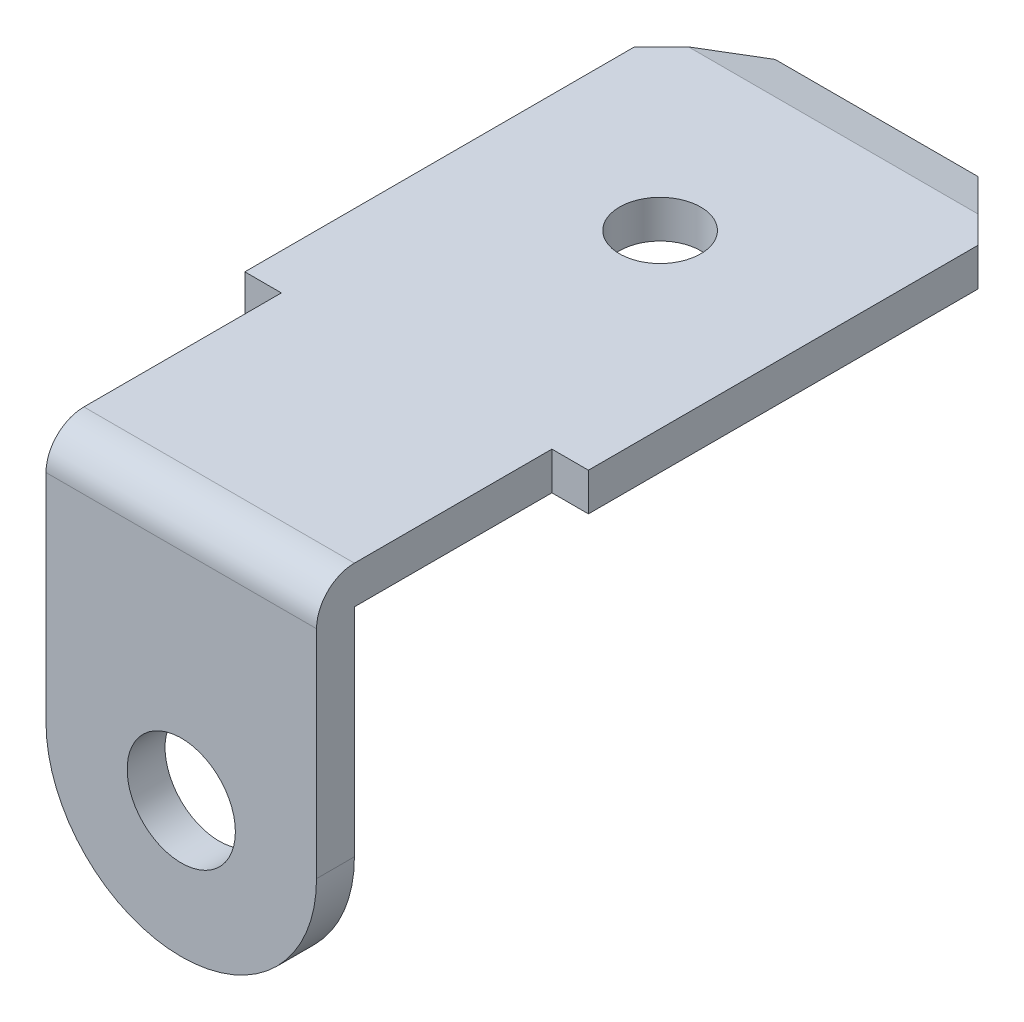
ISO-10303-21;
HEADER;
FILE_DESCRIPTION(('STEP AP214'),'2;1');
FILE_NAME('part.step','',(''),(''),'','','');
FILE_SCHEMA(('AUTOMOTIVE_DESIGN { 1 0 10303 214 1 1 1 1 }'));
ENDSEC;
DATA;
#1=APPLICATION_CONTEXT('core data for automotive mechanical design processes');
#2=APPLICATION_PROTOCOL_DEFINITION('international standard','automotive_design',2000,#1);
#3=PRODUCT_CONTEXT('',#1,'mechanical');
#4=PRODUCT('Part','Part','',(#3));
#5=PRODUCT_RELATED_PRODUCT_CATEGORY('part','',(#4));
#6=PRODUCT_DEFINITION_FORMATION('','',#4);
#7=PRODUCT_DEFINITION_CONTEXT('part definition',#1,'design');
#8=PRODUCT_DEFINITION('design','',#6,#7);
#9=PRODUCT_DEFINITION_SHAPE('','',#8);
#10=(LENGTH_UNIT() NAMED_UNIT(*) SI_UNIT(.MILLI.,.METRE.));
#11=(NAMED_UNIT(*) PLANE_ANGLE_UNIT() SI_UNIT($,.RADIAN.));
#12=(NAMED_UNIT(*) SI_UNIT($,.STERADIAN.) SOLID_ANGLE_UNIT());
#13=UNCERTAINTY_MEASURE_WITH_UNIT(LENGTH_MEASURE(1.E-05),#10,'distance_accuracy_value','');
#14=(GEOMETRIC_REPRESENTATION_CONTEXT(3) GLOBAL_UNCERTAINTY_ASSIGNED_CONTEXT((#13)) GLOBAL_UNIT_ASSIGNED_CONTEXT((#10,
#11,#12)) REPRESENTATION_CONTEXT('',''));
#15=CARTESIAN_POINT('',(0.,0.,0.));
#16=DIRECTION('',(0.,0.,1.));
#17=DIRECTION('',(1.,0.,0.));
#18=AXIS2_PLACEMENT_3D('',#15,#16,#17);
#19=CARTESIAN_POINT('',(0.,0.,0.));
#20=DIRECTION('',(0.,0.,1.));
#21=DIRECTION('',(1.,0.,0.));
#22=AXIS2_PLACEMENT_3D('',#19,#20,#21);
#23=CYLINDRICAL_SURFACE('',#22,1.);
#24=CARTESIAN_POINT('',(0.,0.,0.));
#25=DIRECTION('',(0.,0.,1.));
#26=DIRECTION('',(1.,0.,0.));
#27=AXIS2_PLACEMENT_3D('',#24,#25,#26);
#28=CIRCLE('',#27,1.);
#29=CARTESIAN_POINT('',(1.,0.,0.));
#30=VERTEX_POINT('',#29);
#31=EDGE_CURVE('E298',#30,#30,#28,.T.);
#32=ORIENTED_EDGE('',*,*,#31,.T.);
#33=DIRECTION('',(0.,0.,-1.));
#34=VECTOR('',#33,1.);
#35=CARTESIAN_POINT('',(1.,0.,0.));
#36=LINE('',#35,#34);
#37=CARTESIAN_POINT('',(1.,0.,-0.7));
#38=VERTEX_POINT('',#37);
#39=EDGE_CURVE('E11',#30,#38,#36,.T.);
#40=ORIENTED_EDGE('',*,*,#39,.T.);
#41=CARTESIAN_POINT('',(0.,0.,-0.7));
#42=DIRECTION('',(0.,0.,1.));
#43=DIRECTION('',(1.,0.,0.));
#44=AXIS2_PLACEMENT_3D('',#41,#42,#43);
#45=CIRCLE('',#44,1.);
#46=EDGE_CURVE('E21',#38,#38,#45,.T.);
#47=ORIENTED_EDGE('',*,*,#46,.F.);
#48=ORIENTED_EDGE('',*,*,#39,.F.);
#49=EDGE_LOOP('',(#32,#40,#47,#48));
#50=FACE_BOUND('',#49,.T.);
#51=ADVANCED_FACE('F17',(#50),#23,.F.);
#52=CARTESIAN_POINT('',(0.,1.283011768991,-0.7));
#53=DIRECTION('',(0.,0.,1.));
#54=DIRECTION('',(1.,0.,0.));
#55=AXIS2_PLACEMENT_3D('',#52,#53,#54);
#56=PLANE('',#55);
#57=ORIENTED_EDGE('',*,*,#46,.T.);
#58=EDGE_LOOP('',(#57));
#59=FACE_BOUND('',#58,.T.);
#60=DIRECTION('',(-1.,0.,0.));
#61=VECTOR('',#60,1.);
#62=CARTESIAN_POINT('',(2.5,4.,-0.7));
#63=LINE('',#62,#61);
#64=CARTESIAN_POINT('',(2.5,4.,-0.7));
#65=VERTEX_POINT('',#64);
#66=CARTESIAN_POINT('',(-2.5,4.,-0.7));
#67=VERTEX_POINT('',#66);
#68=EDGE_CURVE('E292',#65,#67,#63,.T.);
#69=ORIENTED_EDGE('',*,*,#68,.F.);
#70=DIRECTION('',(0.,1.,0.));
#71=VECTOR('',#70,1.);
#72=CARTESIAN_POINT('',(2.5,0.,-0.7));
#73=LINE('',#72,#71);
#74=CARTESIAN_POINT('',(2.5,0.,-0.7));
#75=VERTEX_POINT('',#74);
#76=EDGE_CURVE('E274',#75,#65,#73,.T.);
#77=ORIENTED_EDGE('',*,*,#76,.F.);
#78=CARTESIAN_POINT('',(0.,0.,-0.7));
#79=DIRECTION('',(0.,0.,1.));
#80=DIRECTION('',(1.,0.,0.));
#81=AXIS2_PLACEMENT_3D('',#78,#79,#80);
#82=CIRCLE('',#81,2.5);
#83=CARTESIAN_POINT('',(-2.5,0.,-0.7));
#84=VERTEX_POINT('',#83);
#85=EDGE_CURVE('E300',#84,#75,#82,.T.);
#86=ORIENTED_EDGE('',*,*,#85,.F.);
#87=DIRECTION('',(0.,-1.,0.));
#88=VECTOR('',#87,1.);
#89=CARTESIAN_POINT('',(-2.5,4.7,-0.7));
#90=LINE('',#89,#88);
#91=EDGE_CURVE('E247',#67,#84,#90,.T.);
#92=ORIENTED_EDGE('',*,*,#91,.F.);
#93=EDGE_LOOP('',(#69,#77,#86,#92));
#94=FACE_BOUND('',#93,.T.);
#95=ADVANCED_FACE('F19',(#59,#94),#56,.F.);
#96=CARTESIAN_POINT('',(0.,0.,0.));
#97=DIRECTION('',(0.,0.,1.));
#98=DIRECTION('',(1.,0.,0.));
#99=AXIS2_PLACEMENT_3D('',#96,#97,#98);
#100=CYLINDRICAL_SURFACE('',#99,2.5);
#101=DIRECTION('',(0.,0.,-1.));
#102=VECTOR('',#101,1.);
#103=CARTESIAN_POINT('',(-2.5,0.,0.));
#104=LINE('',#103,#102);
#105=CARTESIAN_POINT('',(-2.5,0.,0.));
#106=VERTEX_POINT('',#105);
#107=EDGE_CURVE('E251',#106,#84,#104,.T.);
#108=ORIENTED_EDGE('',*,*,#107,.T.);
#109=ORIENTED_EDGE('',*,*,#85,.T.);
#110=DIRECTION('',(0.,0.,-1.));
#111=VECTOR('',#110,1.);
#112=CARTESIAN_POINT('',(2.5,0.,0.));
#113=LINE('',#112,#111);
#114=CARTESIAN_POINT('',(2.5,0.,0.));
#115=VERTEX_POINT('',#114);
#116=EDGE_CURVE('E270',#115,#75,#113,.T.);
#117=ORIENTED_EDGE('',*,*,#116,.F.);
#118=CARTESIAN_POINT('',(0.,0.,0.));
#119=DIRECTION('',(0.,0.,1.));
#120=DIRECTION('',(1.,0.,0.));
#121=AXIS2_PLACEMENT_3D('',#118,#119,#120);
#122=CIRCLE('',#121,2.5);
#123=EDGE_CURVE('E295',#106,#115,#122,.T.);
#124=ORIENTED_EDGE('',*,*,#123,.F.);
#125=EDGE_LOOP('',(#108,#109,#117,#124));
#126=FACE_BOUND('',#125,.T.);
#127=ADVANCED_FACE('F319',(#126),#100,.T.);
#128=CARTESIAN_POINT('',(0.,1.283011768991,0.));
#129=DIRECTION('',(0.,0.,1.));
#130=DIRECTION('',(1.,0.,0.));
#131=AXIS2_PLACEMENT_3D('',#128,#129,#130);
#132=PLANE('',#131);
#133=ORIENTED_EDGE('',*,*,#31,.F.);
#134=EDGE_LOOP('',(#133));
#135=FACE_BOUND('',#134,.T.);
#136=DIRECTION('',(0.,1.,0.));
#137=VECTOR('',#136,1.);
#138=CARTESIAN_POINT('',(2.5,0.,0.));
#139=LINE('',#138,#137);
#140=CARTESIAN_POINT('',(2.5,4.,0.));
#141=VERTEX_POINT('',#140);
#142=EDGE_CURVE('E267',#115,#141,#139,.T.);
#143=ORIENTED_EDGE('',*,*,#142,.T.);
#144=DIRECTION('',(1.,0.,0.));
#145=VECTOR('',#144,1.);
#146=CARTESIAN_POINT('',(-2.5,4.,0.));
#147=LINE('',#146,#145);
#148=CARTESIAN_POINT('',(-2.5,4.,0.));
#149=VERTEX_POINT('',#148);
#150=EDGE_CURVE('E262',#149,#141,#147,.T.);
#151=ORIENTED_EDGE('',*,*,#150,.F.);
#152=DIRECTION('',(0.,-1.,0.));
#153=VECTOR('',#152,1.);
#154=CARTESIAN_POINT('',(-2.5,4.7,0.));
#155=LINE('',#154,#153);
#156=EDGE_CURVE('E229',#149,#106,#155,.T.);
#157=ORIENTED_EDGE('',*,*,#156,.T.);
#158=ORIENTED_EDGE('',*,*,#123,.T.);
#159=EDGE_LOOP('',(#143,#151,#157,#158));
#160=FACE_BOUND('',#159,.T.);
#161=ADVANCED_FACE('F353',(#135,#160),#132,.T.);
#162=CARTESIAN_POINT('',(0.,4.,-6.852754078708));
#163=DIRECTION('',(0.,1.,0.));
#164=DIRECTION('',(0.,0.,-1.));
#165=AXIS2_PLACEMENT_3D('',#162,#163,#164);
#166=PLANE('',#165);
#167=CARTESIAN_POINT('',(0.,4.,-8.85));
#168=DIRECTION('',(0.,1.,0.));
#169=DIRECTION('',(-1.,0.,0.));
#170=AXIS2_PLACEMENT_3D('',#167,#168,#169);
#171=CIRCLE('',#170,0.75);
#172=CARTESIAN_POINT('',(-0.75,4.,-8.85));
#173=VERTEX_POINT('',#172);
#174=EDGE_CURVE('E210',#173,#173,#171,.T.);
#175=ORIENTED_EDGE('',*,*,#174,.T.);
#176=EDGE_LOOP('',(#175));
#177=FACE_BOUND('',#176,.T.);
#178=DIRECTION('',(1.,0.,0.));
#179=VECTOR('',#178,1.);
#180=CARTESIAN_POINT('',(-1.875,4.,-12.05));
#181=LINE('',#180,#179);
#182=CARTESIAN_POINT('',(-2.675,4.,-12.05));
#183=VERTEX_POINT('',#182);
#184=CARTESIAN_POINT('',(2.675,4.,-12.05));
#185=VERTEX_POINT('',#184);
#186=EDGE_CURVE('E289',#183,#185,#181,.T.);
#187=ORIENTED_EDGE('',*,*,#186,.T.);
#188=DIRECTION('',(-0.707106781186548,0.,-0.707106781186548));
#189=VECTOR('',#188,1.);
#190=CARTESIAN_POINT('',(3.175,4.,-11.55));
#191=LINE('',#190,#189);
#192=CARTESIAN_POINT('',(3.175,4.,-11.55));
#193=VERTEX_POINT('',#192);
#194=EDGE_CURVE('E219',#193,#185,#191,.T.);
#195=ORIENTED_EDGE('',*,*,#194,.F.);
#196=DIRECTION('',(0.,0.,1.));
#197=VECTOR('',#196,1.);
#198=CARTESIAN_POINT('',(3.175,4.,-11.55));
#199=LINE('',#198,#197);
#200=CARTESIAN_POINT('',(3.175,4.,-4.35));
#201=VERTEX_POINT('',#200);
#202=EDGE_CURVE('E240',#193,#201,#199,.T.);
#203=ORIENTED_EDGE('',*,*,#202,.T.);
#204=DIRECTION('',(-1.,0.,0.));
#205=VECTOR('',#204,1.);
#206=CARTESIAN_POINT('',(3.175,4.,-4.35));
#207=LINE('',#206,#205);
#208=CARTESIAN_POINT('',(2.5,4.,-4.35));
#209=VERTEX_POINT('',#208);
#210=EDGE_CURVE('E258',#201,#209,#207,.T.);
#211=ORIENTED_EDGE('',*,*,#210,.T.);
#212=DIRECTION('',(0.,0.,1.));
#213=VECTOR('',#212,1.);
#214=CARTESIAN_POINT('',(2.5,4.,-4.35));
#215=LINE('',#214,#213);
#216=EDGE_CURVE('E278',#209,#65,#215,.T.);
#217=ORIENTED_EDGE('',*,*,#216,.T.);
#218=ORIENTED_EDGE('',*,*,#68,.T.);
#219=DIRECTION('',(0.,0.,-1.));
#220=VECTOR('',#219,1.);
#221=CARTESIAN_POINT('',(-2.5,4.,-0.7));
#222=LINE('',#221,#220);
#223=CARTESIAN_POINT('',(-2.5,4.,-4.35));
#224=VERTEX_POINT('',#223);
#225=EDGE_CURVE('E244',#67,#224,#222,.T.);
#226=ORIENTED_EDGE('',*,*,#225,.T.);
#227=DIRECTION('',(-1.,0.,0.));
#228=VECTOR('',#227,1.);
#229=CARTESIAN_POINT('',(-2.5,4.,-4.35));
#230=LINE('',#229,#228);
#231=CARTESIAN_POINT('',(-3.175,4.,-4.35));
#232=VERTEX_POINT('',#231);
#233=EDGE_CURVE('E224',#224,#232,#230,.T.);
#234=ORIENTED_EDGE('',*,*,#233,.T.);
#235=DIRECTION('',(0.,0.,-1.));
#236=VECTOR('',#235,1.);
#237=CARTESIAN_POINT('',(-3.175,4.,-4.35));
#238=LINE('',#237,#236);
#239=CARTESIAN_POINT('',(-3.175,4.,-11.55));
#240=VERTEX_POINT('',#239);
#241=EDGE_CURVE('E196',#232,#240,#238,.T.);
#242=ORIENTED_EDGE('',*,*,#241,.T.);
#243=DIRECTION('',(0.707106781186548,0.,-0.707106781186548));
#244=VECTOR('',#243,1.);
#245=CARTESIAN_POINT('',(-3.175,4.,-11.55));
#246=LINE('',#245,#244);
#247=EDGE_CURVE('E439',#240,#183,#246,.T.);
#248=ORIENTED_EDGE('',*,*,#247,.T.);
#249=EDGE_LOOP('',(#187,#195,#203,#211,#217,#218,#226,#234,#242,#248));
#250=FACE_BOUND('',#249,.T.);
#251=ADVANCED_FACE('F356',(#177,#250),#166,.F.);
#252=CARTESIAN_POINT('',(-1.875,4.1,-12.45));
#253=DIRECTION('',(0.,-0.970142500145391,-0.242535625036098));
#254=DIRECTION('',(0.,0.242535625036098,-0.970142500145391));
#255=AXIS2_PLACEMENT_3D('',#252,#253,#254);
#256=PLANE('',#255);
#257=DIRECTION('',(1.,0.,0.));
#258=VECTOR('',#257,1.);
#259=CARTESIAN_POINT('',(-1.875,4.2,-12.85));
#260=LINE('',#259,#258);
#261=CARTESIAN_POINT('',(-1.875,4.2,-12.85));
#262=VERTEX_POINT('',#261);
#263=CARTESIAN_POINT('',(1.875,4.2,-12.85));
#264=VERTEX_POINT('',#263);
#265=EDGE_CURVE('E286',#262,#264,#260,.T.);
#266=ORIENTED_EDGE('',*,*,#265,.T.);
#267=DIRECTION('',(-0.696310623822761,0.17407765595594,-0.696310623822761));
#268=VECTOR('',#267,1.);
#269=CARTESIAN_POINT('',(1.668939393939,4.251515151515,-13.05606060606));
#270=LINE('',#269,#268);
#271=EDGE_CURVE('E182',#185,#264,#270,.T.);
#272=ORIENTED_EDGE('',*,*,#271,.F.);
#273=ORIENTED_EDGE('',*,*,#186,.F.);
#274=DIRECTION('',(0.696310623822761,0.17407765595594,-0.696310623822761));
#275=VECTOR('',#274,1.);
#276=CARTESIAN_POINT('',(-2.57803030303,4.024242424242,-12.14696969697));
#277=LINE('',#276,#275);
#278=EDGE_CURVE('E436',#183,#262,#277,.T.);
#279=ORIENTED_EDGE('',*,*,#278,.T.);
#280=EDGE_LOOP('',(#266,#272,#273,#279));
#281=FACE_BOUND('',#280,.T.);
#282=ADVANCED_FACE('F370',(#281),#256,.T.);
#283=CARTESIAN_POINT('',(-1.875,4.7,-12.85));
#284=DIRECTION('',(0.,0.,1.));
#285=DIRECTION('',(0.,-1.,0.));
#286=AXIS2_PLACEMENT_3D('',#283,#284,#285);
#287=PLANE('',#286);
#288=DIRECTION('',(1.,0.,0.));
#289=VECTOR('',#288,1.);
#290=CARTESIAN_POINT('',(-1.875,4.5,-12.85));
#291=LINE('',#290,#289);
#292=CARTESIAN_POINT('',(-1.875,4.5,-12.85));
#293=VERTEX_POINT('',#292);
#294=CARTESIAN_POINT('',(1.875,4.5,-12.85));
#295=VERTEX_POINT('',#294);
#296=EDGE_CURVE('E189',#293,#295,#291,.T.);
#297=ORIENTED_EDGE('',*,*,#296,.T.);
#298=DIRECTION('',(0.,-1.,0.));
#299=VECTOR('',#298,1.);
#300=CARTESIAN_POINT('',(1.875,4.7,-12.85));
#301=LINE('',#300,#299);
#302=EDGE_CURVE('E173',#295,#264,#301,.T.);
#303=ORIENTED_EDGE('',*,*,#302,.T.);
#304=ORIENTED_EDGE('',*,*,#265,.F.);
#305=DIRECTION('',(0.,-1.,0.));
#306=VECTOR('',#305,1.);
#307=CARTESIAN_POINT('',(-1.875,4.7,-12.85));
#308=LINE('',#307,#306);
#309=EDGE_CURVE('E192',#293,#262,#308,.T.);
#310=ORIENTED_EDGE('',*,*,#309,.F.);
#311=EDGE_LOOP('',(#297,#303,#304,#310));
#312=FACE_BOUND('',#311,.T.);
#313=ADVANCED_FACE('F190',(#312),#287,.F.);
#314=CARTESIAN_POINT('',(0.,4.7,-8.85));
#315=DIRECTION('',(0.,1.,0.));
#316=DIRECTION('',(-1.,0.,0.));
#317=AXIS2_PLACEMENT_3D('',#314,#315,#316);
#318=CYLINDRICAL_SURFACE('',#317,0.75);
#319=CARTESIAN_POINT('',(0.,4.7,-8.85));
#320=DIRECTION('',(0.,1.,0.));
#321=DIRECTION('',(-1.,0.,0.));
#322=AXIS2_PLACEMENT_3D('',#319,#320,#321);
#323=CIRCLE('',#322,0.75);
#324=CARTESIAN_POINT('',(-0.75,4.7,-8.85));
#325=VERTEX_POINT('',#324);
#326=EDGE_CURVE('E417',#325,#325,#323,.T.);
#327=ORIENTED_EDGE('',*,*,#326,.T.);
#328=DIRECTION('',(0.,-1.,0.));
#329=VECTOR('',#328,1.);
#330=CARTESIAN_POINT('',(-0.75,4.7,-8.85));
#331=LINE('',#330,#329);
#332=EDGE_CURVE('E282',#325,#173,#331,.T.);
#333=ORIENTED_EDGE('',*,*,#332,.T.);
#334=ORIENTED_EDGE('',*,*,#174,.F.);
#335=ORIENTED_EDGE('',*,*,#332,.F.);
#336=EDGE_LOOP('',(#327,#333,#334,#335));
#337=FACE_BOUND('',#336,.T.);
#338=ADVANCED_FACE('F341',(#337),#318,.F.);
#339=CARTESIAN_POINT('',(2.5,3.156629834254,-1.368370165746));
#340=DIRECTION('',(1.,0.,0.));
#341=DIRECTION('',(0.,1.,0.));
#342=AXIS2_PLACEMENT_3D('',#339,#340,#341);
#343=PLANE('',#342);
#344=DIRECTION('',(0.,0.,1.));
#345=VECTOR('',#344,1.);
#346=CARTESIAN_POINT('',(2.5,4.7,-4.35));
#347=LINE('',#346,#345);
#348=CARTESIAN_POINT('',(2.5,4.7,-4.35));
#349=VERTEX_POINT('',#348);
#350=CARTESIAN_POINT('',(2.5,4.7,-0.7));
#351=VERTEX_POINT('',#350);
#352=EDGE_CURVE('E400',#349,#351,#347,.T.);
#353=ORIENTED_EDGE('',*,*,#352,.T.);
#354=CARTESIAN_POINT('',(2.5,4.,-0.7));
#355=DIRECTION('',(-1.,0.,0.));
#356=DIRECTION('',(0.,0.,1.));
#357=AXIS2_PLACEMENT_3D('',#354,#355,#356);
#358=CIRCLE('',#357,0.7);
#359=EDGE_CURVE('E266',#141,#351,#358,.T.);
#360=ORIENTED_EDGE('',*,*,#359,.F.);
#361=ORIENTED_EDGE('',*,*,#142,.F.);
#362=ORIENTED_EDGE('',*,*,#116,.T.);
#363=ORIENTED_EDGE('',*,*,#76,.T.);
#364=ORIENTED_EDGE('',*,*,#216,.F.);
#365=DIRECTION('',(0.,-1.,0.));
#366=VECTOR('',#365,1.);
#367=CARTESIAN_POINT('',(2.5,4.7,-4.35));
#368=LINE('',#367,#366);
#369=EDGE_CURVE('E228',#349,#209,#368,.T.);
#370=ORIENTED_EDGE('',*,*,#369,.F.);
#371=EDGE_LOOP('',(#353,#360,#361,#362,#363,#364,#370));
#372=FACE_BOUND('',#371,.T.);
#373=ADVANCED_FACE('F344',(#372),#343,.T.);
#374=CARTESIAN_POINT('',(-2.5,4.,-0.7));
#375=DIRECTION('',(1.,0.,0.));
#376=DIRECTION('',(0.,0.,1.));
#377=AXIS2_PLACEMENT_3D('',#374,#375,#376);
#378=CYLINDRICAL_SURFACE('',#377,0.7);
#379=ORIENTED_EDGE('',*,*,#150,.T.);
#380=ORIENTED_EDGE('',*,*,#359,.T.);
#381=DIRECTION('',(1.,0.,0.));
#382=VECTOR('',#381,1.);
#383=CARTESIAN_POINT('',(-2.5,4.7,-0.7));
#384=LINE('',#383,#382);
#385=CARTESIAN_POINT('',(-2.5,4.7,-0.7));
#386=VERTEX_POINT('',#385);
#387=EDGE_CURVE('E396',#386,#351,#384,.T.);
#388=ORIENTED_EDGE('',*,*,#387,.F.);
#389=CARTESIAN_POINT('',(-2.5,4.,-0.7));
#390=DIRECTION('',(-1.,0.,0.));
#391=DIRECTION('',(0.,0.,1.));
#392=AXIS2_PLACEMENT_3D('',#389,#390,#391);
#393=CIRCLE('',#392,0.7);
#394=EDGE_CURVE('E225',#149,#386,#393,.T.);
#395=ORIENTED_EDGE('',*,*,#394,.F.);
#396=EDGE_LOOP('',(#379,#380,#388,#395));
#397=FACE_BOUND('',#396,.T.);
#398=ADVANCED_FACE('F360',(#397),#378,.T.);
#399=CARTESIAN_POINT('',(3.175,4.7,-4.35));
#400=DIRECTION('',(0.,0.,-1.));
#401=DIRECTION('',(0.,-1.,0.));
#402=AXIS2_PLACEMENT_3D('',#399,#400,#401);
#403=PLANE('',#402);
#404=DIRECTION('',(-1.,0.,0.));
#405=VECTOR('',#404,1.);
#406=CARTESIAN_POINT('',(3.175,4.7,-4.35));
#407=LINE('',#406,#405);
#408=CARTESIAN_POINT('',(3.175,4.7,-4.35));
#409=VERTEX_POINT('',#408);
#410=EDGE_CURVE('E421',#409,#349,#407,.T.);
#411=ORIENTED_EDGE('',*,*,#410,.T.);
#412=ORIENTED_EDGE('',*,*,#369,.T.);
#413=ORIENTED_EDGE('',*,*,#210,.F.);
#414=DIRECTION('',(0.,-1.,0.));
#415=VECTOR('',#414,1.);
#416=CARTESIAN_POINT('',(3.175,4.7,-4.35));
#417=LINE('',#416,#415);
#418=EDGE_CURVE('E236',#409,#201,#417,.T.);
#419=ORIENTED_EDGE('',*,*,#418,.F.);
#420=EDGE_LOOP('',(#411,#412,#413,#419));
#421=FACE_BOUND('',#420,.T.);
#422=ADVANCED_FACE('F351',(#421),#403,.F.);
#423=CARTESIAN_POINT('',(-2.5,3.156629834254,-1.368370165746));
#424=DIRECTION('',(-1.,0.,0.));
#425=DIRECTION('',(0.,0.,1.));
#426=AXIS2_PLACEMENT_3D('',#423,#424,#425);
#427=PLANE('',#426);
#428=DIRECTION('',(0.,0.,-1.));
#429=VECTOR('',#428,1.);
#430=CARTESIAN_POINT('',(-2.5,4.7,0.));
#431=LINE('',#430,#429);
#432=CARTESIAN_POINT('',(-2.5,4.7,-4.35));
#433=VERTEX_POINT('',#432);
#434=EDGE_CURVE('E393',#386,#433,#431,.T.);
#435=ORIENTED_EDGE('',*,*,#434,.T.);
#436=DIRECTION('',(0.,-1.,0.));
#437=VECTOR('',#436,1.);
#438=CARTESIAN_POINT('',(-2.5,4.7,-4.35));
#439=LINE('',#438,#437);
#440=EDGE_CURVE('E232',#433,#224,#439,.T.);
#441=ORIENTED_EDGE('',*,*,#440,.T.);
#442=ORIENTED_EDGE('',*,*,#225,.F.);
#443=ORIENTED_EDGE('',*,*,#91,.T.);
#444=ORIENTED_EDGE('',*,*,#107,.F.);
#445=ORIENTED_EDGE('',*,*,#156,.F.);
#446=ORIENTED_EDGE('',*,*,#394,.T.);
#447=EDGE_LOOP('',(#435,#441,#442,#443,#444,#445,#446));
#448=FACE_BOUND('',#447,.T.);
#449=ADVANCED_FACE('F339',(#448),#427,.T.);
#450=CARTESIAN_POINT('',(3.175,4.7,-11.55));
#451=DIRECTION('',(-1.,0.,0.));
#452=DIRECTION('',(0.,0.,1.));
#453=AXIS2_PLACEMENT_3D('',#450,#451,#452);
#454=PLANE('',#453);
#455=DIRECTION('',(0.,0.,1.));
#456=VECTOR('',#455,1.);
#457=CARTESIAN_POINT('',(3.175,4.7,-11.55));
#458=LINE('',#457,#456);
#459=CARTESIAN_POINT('',(3.175,4.7,-11.55));
#460=VERTEX_POINT('',#459);
#461=EDGE_CURVE('E424',#460,#409,#458,.T.);
#462=ORIENTED_EDGE('',*,*,#461,.T.);
#463=ORIENTED_EDGE('',*,*,#418,.T.);
#464=ORIENTED_EDGE('',*,*,#202,.F.);
#465=DIRECTION('',(0.,-1.,0.));
#466=VECTOR('',#465,1.);
#467=CARTESIAN_POINT('',(3.175,4.7,-11.55));
#468=LINE('',#467,#466);
#469=EDGE_CURVE('E185',#460,#193,#468,.T.);
#470=ORIENTED_EDGE('',*,*,#469,.F.);
#471=EDGE_LOOP('',(#462,#463,#464,#470));
#472=FACE_BOUND('',#471,.T.);
#473=ADVANCED_FACE('F336',(#472),#454,.F.);
#474=CARTESIAN_POINT('',(-2.5,4.7,-4.35));
#475=DIRECTION('',(0.,0.,-1.));
#476=DIRECTION('',(0.,-1.,0.));
#477=AXIS2_PLACEMENT_3D('',#474,#475,#476);
#478=PLANE('',#477);
#479=DIRECTION('',(-1.,0.,0.));
#480=VECTOR('',#479,1.);
#481=CARTESIAN_POINT('',(-2.5,4.7,-4.35));
#482=LINE('',#481,#480);
#483=CARTESIAN_POINT('',(-3.175,4.7,-4.35));
#484=VERTEX_POINT('',#483);
#485=EDGE_CURVE('E405',#433,#484,#482,.T.);
#486=ORIENTED_EDGE('',*,*,#485,.T.);
#487=DIRECTION('',(0.,-1.,0.));
#488=VECTOR('',#487,1.);
#489=CARTESIAN_POINT('',(-3.175,4.7,-4.35));
#490=LINE('',#489,#488);
#491=EDGE_CURVE('E186',#484,#232,#490,.T.);
#492=ORIENTED_EDGE('',*,*,#491,.T.);
#493=ORIENTED_EDGE('',*,*,#233,.F.);
#494=ORIENTED_EDGE('',*,*,#440,.F.);
#495=EDGE_LOOP('',(#486,#492,#493,#494));
#496=FACE_BOUND('',#495,.T.);
#497=ADVANCED_FACE('F335',(#496),#478,.F.);
#498=CARTESIAN_POINT('',(3.175,4.7,-11.55));
#499=DIRECTION('',(0.707106781186548,0.,-0.707106781186548));
#500=DIRECTION('',(0.,-1.,0.));
#501=AXIS2_PLACEMENT_3D('',#498,#499,#500);
#502=PLANE('',#501);
#503=ORIENTED_EDGE('',*,*,#302,.F.);
#504=DIRECTION('',(-0.696310623822761,-0.17407765595594,-0.696310623822761));
#505=VECTOR('',#504,1.);
#506=CARTESIAN_POINT('',(1.711363636364,4.459090909091,-13.01363636363));
#507=LINE('',#506,#505);
#508=CARTESIAN_POINT('',(2.675,4.7,-12.05));
#509=VERTEX_POINT('',#508);
#510=EDGE_CURVE('E178',#509,#295,#507,.T.);
#511=ORIENTED_EDGE('',*,*,#510,.F.);
#512=DIRECTION('',(-0.707106781186548,0.,-0.707106781186548));
#513=VECTOR('',#512,1.);
#514=CARTESIAN_POINT('',(3.175,4.7,-11.55));
#515=LINE('',#514,#513);
#516=EDGE_CURVE('E418',#460,#509,#515,.T.);
#517=ORIENTED_EDGE('',*,*,#516,.F.);
#518=ORIENTED_EDGE('',*,*,#469,.T.);
#519=ORIENTED_EDGE('',*,*,#194,.T.);
#520=ORIENTED_EDGE('',*,*,#271,.T.);
#521=EDGE_LOOP('',(#503,#511,#517,#518,#519,#520));
#522=FACE_BOUND('',#521,.T.);
#523=ADVANCED_FACE('F175',(#522),#502,.T.);
#524=CARTESIAN_POINT('',(-3.175,4.7,-4.35));
#525=DIRECTION('',(1.,0.,0.));
#526=DIRECTION('',(0.,1.,0.));
#527=AXIS2_PLACEMENT_3D('',#524,#525,#526);
#528=PLANE('',#527);
#529=DIRECTION('',(0.,0.,-1.));
#530=VECTOR('',#529,1.);
#531=CARTESIAN_POINT('',(-3.175,4.7,-4.35));
#532=LINE('',#531,#530);
#533=CARTESIAN_POINT('',(-3.175,4.7,-11.55));
#534=VERTEX_POINT('',#533);
#535=EDGE_CURVE('E410',#484,#534,#532,.T.);
#536=ORIENTED_EDGE('',*,*,#535,.T.);
#537=DIRECTION('',(0.,-1.,0.));
#538=VECTOR('',#537,1.);
#539=CARTESIAN_POINT('',(-3.175,4.7,-11.55));
#540=LINE('',#539,#538);
#541=EDGE_CURVE('E430',#534,#240,#540,.T.);
#542=ORIENTED_EDGE('',*,*,#541,.T.);
#543=ORIENTED_EDGE('',*,*,#241,.F.);
#544=ORIENTED_EDGE('',*,*,#491,.F.);
#545=EDGE_LOOP('',(#536,#542,#543,#544));
#546=FACE_BOUND('',#545,.T.);
#547=ADVANCED_FACE('F326',(#546),#528,.F.);
#548=CARTESIAN_POINT('',(-1.875,4.6,-12.45));
#549=DIRECTION('',(0.,-0.970142500145391,0.242535625036098));
#550=DIRECTION('',(-1.,0.,0.));
#551=AXIS2_PLACEMENT_3D('',#548,#549,#550);
#552=PLANE('',#551);
#553=DIRECTION('',(0.696310623822761,-0.17407765595594,-0.696310623822761));
#554=VECTOR('',#553,1.);
#555=CARTESIAN_POINT('',(-2.620454545455,4.686363636364,-12.10454545454));
#556=LINE('',#555,#554);
#557=CARTESIAN_POINT('',(-2.675,4.7,-12.05));
#558=VERTEX_POINT('',#557);
#559=EDGE_CURVE('E207',#558,#293,#556,.T.);
#560=ORIENTED_EDGE('',*,*,#559,.F.);
#561=DIRECTION('',(1.,0.,0.));
#562=VECTOR('',#561,1.);
#563=CARTESIAN_POINT('',(-1.875,4.7,-12.05));
#564=LINE('',#563,#562);
#565=EDGE_CURVE('E200',#558,#509,#564,.T.);
#566=ORIENTED_EDGE('',*,*,#565,.T.);
#567=ORIENTED_EDGE('',*,*,#510,.T.);
#568=ORIENTED_EDGE('',*,*,#296,.F.);
#569=EDGE_LOOP('',(#560,#566,#567,#568));
#570=FACE_BOUND('',#569,.T.);
#571=ADVANCED_FACE('F198',(#570),#552,.F.);
#572=CARTESIAN_POINT('',(-3.175,4.7,-11.55));
#573=DIRECTION('',(0.707106781186548,0.,0.707106781186548));
#574=DIRECTION('',(0.,-1.,0.));
#575=AXIS2_PLACEMENT_3D('',#572,#573,#574);
#576=PLANE('',#575);
#577=ORIENTED_EDGE('',*,*,#278,.F.);
#578=ORIENTED_EDGE('',*,*,#247,.F.);
#579=ORIENTED_EDGE('',*,*,#541,.F.);
#580=DIRECTION('',(0.707106781186548,0.,-0.707106781186548));
#581=VECTOR('',#580,1.);
#582=CARTESIAN_POINT('',(-3.175,4.7,-11.55));
#583=LINE('',#582,#581);
#584=EDGE_CURVE('E571',#534,#558,#583,.T.);
#585=ORIENTED_EDGE('',*,*,#584,.T.);
#586=ORIENTED_EDGE('',*,*,#559,.T.);
#587=ORIENTED_EDGE('',*,*,#309,.T.);
#588=EDGE_LOOP('',(#577,#578,#579,#585,#586,#587));
#589=FACE_BOUND('',#588,.T.);
#590=ADVANCED_FACE('F325',(#589),#576,.F.);
#591=CARTESIAN_POINT('',(0.,4.7,-6.299906067267));
#592=DIRECTION('',(0.,1.,0.));
#593=DIRECTION('',(0.,0.,-1.));
#594=AXIS2_PLACEMENT_3D('',#591,#592,#593);
#595=PLANE('',#594);
#596=ORIENTED_EDGE('',*,*,#326,.F.);
#597=EDGE_LOOP('',(#596));
#598=FACE_BOUND('',#597,.T.);
#599=ORIENTED_EDGE('',*,*,#584,.F.);
#600=ORIENTED_EDGE('',*,*,#535,.F.);
#601=ORIENTED_EDGE('',*,*,#485,.F.);
#602=ORIENTED_EDGE('',*,*,#434,.F.);
#603=ORIENTED_EDGE('',*,*,#387,.T.);
#604=ORIENTED_EDGE('',*,*,#352,.F.);
#605=ORIENTED_EDGE('',*,*,#410,.F.);
#606=ORIENTED_EDGE('',*,*,#461,.F.);
#607=ORIENTED_EDGE('',*,*,#516,.T.);
#608=ORIENTED_EDGE('',*,*,#565,.F.);
#609=EDGE_LOOP('',(#599,#600,#601,#602,#603,#604,#605,#606,#607,#608));
#610=FACE_BOUND('',#609,.T.);
#611=ADVANCED_FACE('F322',(#598,#610),#595,.T.);
#612=CLOSED_SHELL('',(#51,#95,#127,#161,#251,#282,#313,#338,#373,#398,#422,#449,#473,#497,#523,
#547,#571,#590,#611));
#613=MANIFOLD_SOLID_BREP('B1',#612);
#614=ADVANCED_BREP_SHAPE_REPRESENTATION('',(#18,#613),#14);
#615=SHAPE_DEFINITION_REPRESENTATION(#9,#614);
ENDSEC;
END-ISO-10303-21;
